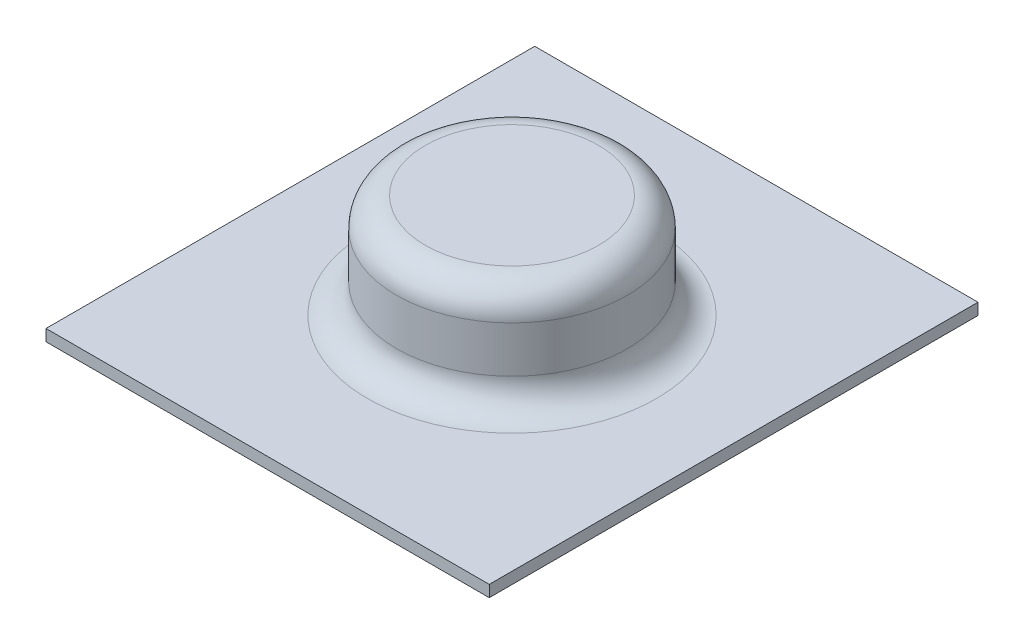
ISO-10303-21;
HEADER;
FILE_DESCRIPTION(('STEP AP214'),'2;1');
FILE_NAME('part.step','',(''),(''),'','','');
FILE_SCHEMA(('AUTOMOTIVE_DESIGN { 1 0 10303 214 1 1 1 1 }'));
ENDSEC;
DATA;
#1=APPLICATION_CONTEXT('core data for automotive mechanical design processes');
#2=APPLICATION_PROTOCOL_DEFINITION('international standard','automotive_design',2000,#1);
#3=PRODUCT_CONTEXT('',#1,'mechanical');
#4=PRODUCT('Part','Part','',(#3));
#5=PRODUCT_RELATED_PRODUCT_CATEGORY('part','',(#4));
#6=PRODUCT_DEFINITION_FORMATION('','',#4);
#7=PRODUCT_DEFINITION_CONTEXT('part definition',#1,'design');
#8=PRODUCT_DEFINITION('design','',#6,#7);
#9=PRODUCT_DEFINITION_SHAPE('','',#8);
#10=(LENGTH_UNIT() NAMED_UNIT(*) SI_UNIT(.MILLI.,.METRE.));
#11=(NAMED_UNIT(*) PLANE_ANGLE_UNIT() SI_UNIT($,.RADIAN.));
#12=(NAMED_UNIT(*) SI_UNIT($,.STERADIAN.) SOLID_ANGLE_UNIT());
#13=UNCERTAINTY_MEASURE_WITH_UNIT(LENGTH_MEASURE(1.E-05),#10,'distance_accuracy_value','');
#14=(GEOMETRIC_REPRESENTATION_CONTEXT(3) GLOBAL_UNCERTAINTY_ASSIGNED_CONTEXT((#13)) GLOBAL_UNIT_ASSIGNED_CONTEXT((#10,
#11,#12)) REPRESENTATION_CONTEXT('',''));
#15=CARTESIAN_POINT('',(0.,0.,0.));
#16=DIRECTION('',(0.,0.,1.));
#17=DIRECTION('',(1.,0.,0.));
#18=AXIS2_PLACEMENT_3D('',#15,#16,#17);
#19=CARTESIAN_POINT('',(-9.75,0.508,-10.75));
#20=DIRECTION('',(1.,0.,0.));
#21=DIRECTION('',(0.,0.,-1.));
#22=AXIS2_PLACEMENT_3D('',#19,#20,#21);
#23=PLANE('',#22);
#24=DIRECTION('',(0.,0.,1.));
#25=VECTOR('',#24,1.);
#26=CARTESIAN_POINT('',(-9.75,0.,-10.75));
#27=LINE('',#26,#25);
#28=CARTESIAN_POINT('',(-9.75,0.,-10.75));
#29=VERTEX_POINT('',#28);
#30=CARTESIAN_POINT('',(-9.75,0.,10.75));
#31=VERTEX_POINT('',#30);
#32=EDGE_CURVE('E120',#29,#31,#27,.T.);
#33=ORIENTED_EDGE('',*,*,#32,.T.);
#34=DIRECTION('',(0.,-1.,0.));
#35=VECTOR('',#34,1.);
#36=CARTESIAN_POINT('',(-9.75,0.508,10.75));
#37=LINE('',#36,#35);
#38=CARTESIAN_POINT('',(-9.75,0.508,10.75));
#39=VERTEX_POINT('',#38);
#40=EDGE_CURVE('E109',#39,#31,#37,.T.);
#41=ORIENTED_EDGE('',*,*,#40,.F.);
#42=DIRECTION('',(0.,0.,1.));
#43=VECTOR('',#42,1.);
#44=CARTESIAN_POINT('',(-9.75,0.508,-10.75));
#45=LINE('',#44,#43);
#46=CARTESIAN_POINT('',(-9.75,0.508,-10.75));
#47=VERTEX_POINT('',#46);
#48=EDGE_CURVE('E101',#47,#39,#45,.T.);
#49=ORIENTED_EDGE('',*,*,#48,.F.);
#50=DIRECTION('',(0.,-1.,0.));
#51=VECTOR('',#50,1.);
#52=CARTESIAN_POINT('',(-9.75,0.508,-10.75));
#53=LINE('',#52,#51);
#54=EDGE_CURVE('E116',#47,#29,#53,.T.);
#55=ORIENTED_EDGE('',*,*,#54,.T.);
#56=EDGE_LOOP('',(#33,#41,#49,#55));
#57=FACE_BOUND('',#56,.T.);
#58=ADVANCED_FACE('F47',(#57),#23,.F.);
#59=CARTESIAN_POINT('',(9.75,0.508,10.75));
#60=DIRECTION('',(0.,0.,-1.));
#61=DIRECTION('',(-1.,0.,0.));
#62=AXIS2_PLACEMENT_3D('',#59,#60,#61);
#63=PLANE('',#62);
#64=DIRECTION('',(1.,0.,0.));
#65=VECTOR('',#64,1.);
#66=CARTESIAN_POINT('',(9.75,0.,10.75));
#67=LINE('',#66,#65);
#68=CARTESIAN_POINT('',(9.75,0.,10.75));
#69=VERTEX_POINT('',#68);
#70=EDGE_CURVE('E107',#31,#69,#67,.T.);
#71=ORIENTED_EDGE('',*,*,#70,.T.);
#72=DIRECTION('',(0.,-1.,0.));
#73=VECTOR('',#72,1.);
#74=CARTESIAN_POINT('',(9.75,0.508,10.75));
#75=LINE('',#74,#73);
#76=CARTESIAN_POINT('',(9.75,0.508,10.75));
#77=VERTEX_POINT('',#76);
#78=EDGE_CURVE('E105',#77,#69,#75,.T.);
#79=ORIENTED_EDGE('',*,*,#78,.F.);
#80=DIRECTION('',(1.,0.,0.));
#81=VECTOR('',#80,1.);
#82=CARTESIAN_POINT('',(9.75,0.508,10.75));
#83=LINE('',#82,#81);
#84=EDGE_CURVE('E96',#39,#77,#83,.T.);
#85=ORIENTED_EDGE('',*,*,#84,.F.);
#86=ORIENTED_EDGE('',*,*,#40,.T.);
#87=EDGE_LOOP('',(#71,#79,#85,#86));
#88=FACE_BOUND('',#87,.T.);
#89=ADVANCED_FACE('F106',(#88),#63,.F.);
#90=CARTESIAN_POINT('',(9.75,0.508,-10.75));
#91=DIRECTION('',(-1.,0.,0.));
#92=DIRECTION('',(0.,0.,1.));
#93=AXIS2_PLACEMENT_3D('',#90,#91,#92);
#94=PLANE('',#93);
#95=DIRECTION('',(0.,0.,-1.));
#96=VECTOR('',#95,1.);
#97=CARTESIAN_POINT('',(9.75,0.,-10.75));
#98=LINE('',#97,#96);
#99=CARTESIAN_POINT('',(9.75,0.,-10.75));
#100=VERTEX_POINT('',#99);
#101=EDGE_CURVE('E82',#69,#100,#98,.T.);
#102=ORIENTED_EDGE('',*,*,#101,.T.);
#103=DIRECTION('',(0.,-1.,0.));
#104=VECTOR('',#103,1.);
#105=CARTESIAN_POINT('',(9.75,0.508,-10.75));
#106=LINE('',#105,#104);
#107=CARTESIAN_POINT('',(9.75,0.508,-10.75));
#108=VERTEX_POINT('',#107);
#109=EDGE_CURVE('E110',#108,#100,#106,.T.);
#110=ORIENTED_EDGE('',*,*,#109,.F.);
#111=DIRECTION('',(0.,0.,-1.));
#112=VECTOR('',#111,1.);
#113=CARTESIAN_POINT('',(9.75,0.508,-10.75));
#114=LINE('',#113,#112);
#115=EDGE_CURVE('E99',#77,#108,#114,.T.);
#116=ORIENTED_EDGE('',*,*,#115,.F.);
#117=ORIENTED_EDGE('',*,*,#78,.T.);
#118=EDGE_LOOP('',(#102,#110,#116,#117));
#119=FACE_BOUND('',#118,.T.);
#120=ADVANCED_FACE('F112',(#119),#94,.F.);
#121=CARTESIAN_POINT('',(9.75,0.508,-10.75));
#122=DIRECTION('',(0.,0.,1.));
#123=DIRECTION('',(1.,0.,0.));
#124=AXIS2_PLACEMENT_3D('',#121,#122,#123);
#125=PLANE('',#124);
#126=DIRECTION('',(-1.,0.,0.));
#127=VECTOR('',#126,1.);
#128=CARTESIAN_POINT('',(9.75,0.,-10.75));
#129=LINE('',#128,#127);
#130=EDGE_CURVE('E88',#100,#29,#129,.T.);
#131=ORIENTED_EDGE('',*,*,#130,.T.);
#132=ORIENTED_EDGE('',*,*,#54,.F.);
#133=DIRECTION('',(-1.,0.,0.));
#134=VECTOR('',#133,1.);
#135=CARTESIAN_POINT('',(9.75,0.508,-10.75));
#136=LINE('',#135,#134);
#137=EDGE_CURVE('E65',#108,#47,#136,.T.);
#138=ORIENTED_EDGE('',*,*,#137,.F.);
#139=ORIENTED_EDGE('',*,*,#109,.T.);
#140=EDGE_LOOP('',(#131,#132,#138,#139));
#141=FACE_BOUND('',#140,.T.);
#142=ADVANCED_FACE('F179',(#141),#125,.F.);
#143=CARTESIAN_POINT('',(0.,0.508,0.));
#144=DIRECTION('',(0.,-1.,0.));
#145=DIRECTION('',(0.,0.,-1.));
#146=AXIS2_PLACEMENT_3D('',#143,#144,#145);
#147=PLANE('',#146);
#148=CARTESIAN_POINT('',(0.,0.508,0.));
#149=DIRECTION('',(0.,-1.,0.));
#150=DIRECTION('',(0.,0.,-1.));
#151=AXIS2_PLACEMENT_3D('',#148,#149,#150);
#152=CIRCLE('',#151,6.35);
#153=CARTESIAN_POINT('',(0.,0.508,-6.35));
#154=VERTEX_POINT('',#153);
#155=EDGE_CURVE('E57',#154,#154,#152,.T.);
#156=ORIENTED_EDGE('',*,*,#155,.T.);
#157=EDGE_LOOP('',(#156));
#158=FACE_BOUND('',#157,.T.);
#159=ORIENTED_EDGE('',*,*,#48,.T.);
#160=ORIENTED_EDGE('',*,*,#84,.T.);
#161=ORIENTED_EDGE('',*,*,#115,.T.);
#162=ORIENTED_EDGE('',*,*,#137,.T.);
#163=EDGE_LOOP('',(#159,#160,#161,#162));
#164=FACE_BOUND('',#163,.T.);
#165=ADVANCED_FACE('F97',(#158,#164),#147,.F.);
#166=CARTESIAN_POINT('',(0.,0.,0.));
#167=DIRECTION('',(0.,-1.,0.));
#168=DIRECTION('',(0.,0.,-1.));
#169=AXIS2_PLACEMENT_3D('',#166,#167,#168);
#170=PLANE('',#169);
#171=ORIENTED_EDGE('',*,*,#32,.F.);
#172=ORIENTED_EDGE('',*,*,#130,.F.);
#173=ORIENTED_EDGE('',*,*,#101,.F.);
#174=ORIENTED_EDGE('',*,*,#70,.F.);
#175=EDGE_LOOP('',(#171,#172,#173,#174));
#176=FACE_BOUND('',#175,.T.);
#177=ADVANCED_FACE('F157',(#176),#170,.T.);
#178=CARTESIAN_POINT('',(0.,5.08,0.));
#179=DIRECTION('',(0.,-1.,0.));
#180=DIRECTION('',(0.,0.,-1.));
#181=AXIS2_PLACEMENT_3D('',#178,#179,#180);
#182=CYLINDRICAL_SURFACE('',#181,5.08);
#183=CARTESIAN_POINT('',(0.,1.778,0.));
#184=DIRECTION('',(0.,-1.,0.));
#185=DIRECTION('',(0.,0.,-1.));
#186=AXIS2_PLACEMENT_3D('',#183,#184,#185);
#187=CIRCLE('',#186,5.08);
#188=CARTESIAN_POINT('',(0.,1.778,-5.08));
#189=VERTEX_POINT('',#188);
#190=EDGE_CURVE('E140',#189,#189,#187,.F.);
#191=ORIENTED_EDGE('',*,*,#190,.T.);
#192=EDGE_LOOP('',(#191));
#193=FACE_BOUND('',#192,.T.);
#194=CARTESIAN_POINT('',(0.,3.81,0.));
#195=DIRECTION('',(0.,1.,0.));
#196=DIRECTION('',(0.,0.,1.));
#197=AXIS2_PLACEMENT_3D('',#194,#195,#196);
#198=CIRCLE('',#197,5.08);
#199=CARTESIAN_POINT('',(0.,3.81,5.08));
#200=VERTEX_POINT('',#199);
#201=EDGE_CURVE('E136',#200,#200,#198,.F.);
#202=ORIENTED_EDGE('',*,*,#201,.T.);
#203=EDGE_LOOP('',(#202));
#204=FACE_BOUND('',#203,.T.);
#205=ADVANCED_FACE('F154',(#193,#204),#182,.T.);
#206=CARTESIAN_POINT('',(0.,5.08,0.));
#207=DIRECTION('',(0.,1.,0.));
#208=DIRECTION('',(0.,0.,1.));
#209=AXIS2_PLACEMENT_3D('',#206,#207,#208);
#210=PLANE('',#209);
#211=CARTESIAN_POINT('',(0.,5.08,0.));
#212=DIRECTION('',(0.,1.,0.));
#213=DIRECTION('',(0.,0.,1.));
#214=AXIS2_PLACEMENT_3D('',#211,#212,#213);
#215=CIRCLE('',#214,3.81);
#216=CARTESIAN_POINT('',(0.,5.08,3.81));
#217=VERTEX_POINT('',#216);
#218=EDGE_CURVE('E11',#217,#217,#215,.T.);
#219=ORIENTED_EDGE('',*,*,#218,.T.);
#220=EDGE_LOOP('',(#219));
#221=FACE_BOUND('',#220,.T.);
#222=ADVANCED_FACE('F151',(#221),#210,.T.);
#223=CARTESIAN_POINT('',(0.,1.778,0.));
#224=DIRECTION('',(0.,-1.,0.));
#225=DIRECTION('',(0.,0.,-1.));
#226=AXIS2_PLACEMENT_3D('',#223,#224,#225);
#227=TOROIDAL_SURFACE('',#226,6.35,1.27);
#228=ORIENTED_EDGE('',*,*,#155,.F.);
#229=EDGE_LOOP('',(#228));
#230=FACE_BOUND('',#229,.T.);
#231=ORIENTED_EDGE('',*,*,#190,.F.);
#232=EDGE_LOOP('',(#231));
#233=FACE_BOUND('',#232,.T.);
#234=ADVANCED_FACE('F148',(#230,#233),#227,.F.);
#235=CARTESIAN_POINT('',(0.,3.81,0.));
#236=DIRECTION('',(0.,1.,0.));
#237=DIRECTION('',(0.,0.,1.));
#238=AXIS2_PLACEMENT_3D('',#235,#236,#237);
#239=TOROIDAL_SURFACE('',#238,3.81,1.27);
#240=ORIENTED_EDGE('',*,*,#201,.F.);
#241=EDGE_LOOP('',(#240));
#242=FACE_BOUND('',#241,.T.);
#243=ORIENTED_EDGE('',*,*,#218,.F.);
#244=EDGE_LOOP('',(#243));
#245=FACE_BOUND('',#244,.T.);
#246=ADVANCED_FACE('F49',(#242,#245),#239,.T.);
#247=CLOSED_SHELL('',(#58,#89,#120,#142,#165,#177,#205,#222,#234,#246));
#248=MANIFOLD_SOLID_BREP('B2',#247);
#249=ADVANCED_BREP_SHAPE_REPRESENTATION('',(#18,#248),#14);
#250=SHAPE_DEFINITION_REPRESENTATION(#9,#249);
ENDSEC;
END-ISO-10303-21;
